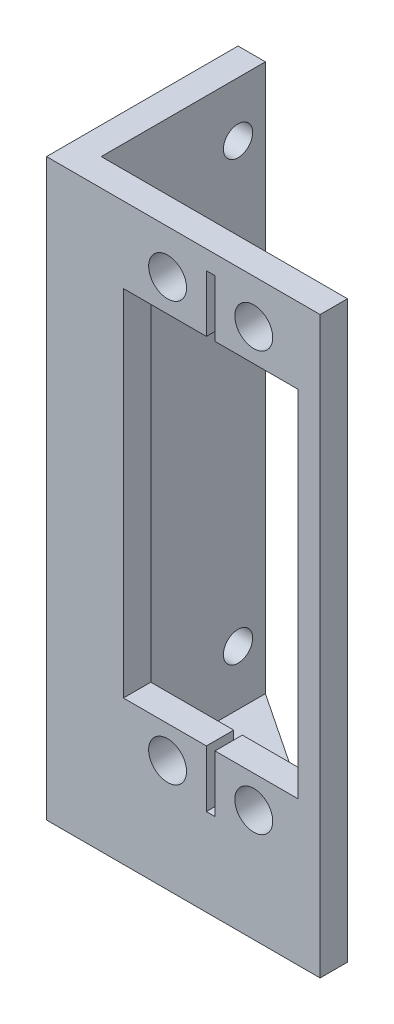
ISO-10303-21;
HEADER;
FILE_DESCRIPTION(('STEP AP214'),'2;1');
FILE_NAME('part.step','',(''),(''),'','','');
FILE_SCHEMA(('AUTOMOTIVE_DESIGN { 1 0 10303 214 1 1 1 1 }'));
ENDSEC;
DATA;
#1=APPLICATION_CONTEXT('core data for automotive mechanical design processes');
#2=APPLICATION_PROTOCOL_DEFINITION('international standard','automotive_design',2000,#1);
#3=PRODUCT_CONTEXT('',#1,'mechanical');
#4=PRODUCT('Part','Part','',(#3));
#5=PRODUCT_RELATED_PRODUCT_CATEGORY('part','',(#4));
#6=PRODUCT_DEFINITION_FORMATION('','',#4);
#7=PRODUCT_DEFINITION_CONTEXT('part definition',#1,'design');
#8=PRODUCT_DEFINITION('design','',#6,#7);
#9=PRODUCT_DEFINITION_SHAPE('','',#8);
#10=(LENGTH_UNIT() NAMED_UNIT(*) SI_UNIT(.MILLI.,.METRE.));
#11=(NAMED_UNIT(*) PLANE_ANGLE_UNIT() SI_UNIT($,.RADIAN.));
#12=(NAMED_UNIT(*) SI_UNIT($,.STERADIAN.) SOLID_ANGLE_UNIT());
#13=UNCERTAINTY_MEASURE_WITH_UNIT(LENGTH_MEASURE(1.E-05),#10,'distance_accuracy_value','');
#14=(GEOMETRIC_REPRESENTATION_CONTEXT(3) GLOBAL_UNCERTAINTY_ASSIGNED_CONTEXT((#13)) GLOBAL_UNIT_ASSIGNED_CONTEXT((#10,
#11,#12)) REPRESENTATION_CONTEXT('',''));
#15=CARTESIAN_POINT('',(0.,0.,0.));
#16=DIRECTION('',(0.,0.,1.));
#17=DIRECTION('',(1.,0.,0.));
#18=AXIS2_PLACEMENT_3D('',#15,#16,#17);
#19=CARTESIAN_POINT('',(31.75,0.,3.175));
#20=DIRECTION('',(-1.,0.,0.));
#21=DIRECTION('',(0.,-1.,0.));
#22=AXIS2_PLACEMENT_3D('',#19,#20,#21);
#23=PLANE('',#22);
#24=DIRECTION('',(0.,1.,0.));
#25=VECTOR('',#24,1.);
#26=CARTESIAN_POINT('',(31.75,0.,0.));
#27=LINE('',#26,#25);
#28=CARTESIAN_POINT('',(31.75,0.,0.));
#29=VERTEX_POINT('',#28);
#30=CARTESIAN_POINT('',(31.75,63.5,0.));
#31=VERTEX_POINT('',#30);
#32=EDGE_CURVE('E347',#29,#31,#27,.T.);
#33=ORIENTED_EDGE('',*,*,#32,.T.);
#34=DIRECTION('',(0.,0.,-1.));
#35=VECTOR('',#34,1.);
#36=CARTESIAN_POINT('',(31.75,63.5,3.175));
#37=LINE('',#36,#35);
#38=CARTESIAN_POINT('',(31.75,63.5,3.175));
#39=VERTEX_POINT('',#38);
#40=EDGE_CURVE('E11',#39,#31,#37,.T.);
#41=ORIENTED_EDGE('',*,*,#40,.F.);
#42=DIRECTION('',(0.,1.,0.));
#43=VECTOR('',#42,1.);
#44=CARTESIAN_POINT('',(31.75,0.,3.175));
#45=LINE('',#44,#43);
#46=CARTESIAN_POINT('',(31.75,-3.175,3.175));
#47=VERTEX_POINT('',#46);
#48=EDGE_CURVE('E337',#47,#39,#45,.T.);
#49=ORIENTED_EDGE('',*,*,#48,.F.);
#50=DIRECTION('',(0.,0.,1.));
#51=VECTOR('',#50,1.);
#52=CARTESIAN_POINT('',(31.75,-3.175,3.175));
#53=LINE('',#52,#51);
#54=CARTESIAN_POINT('',(31.75,-3.175,0.));
#55=VERTEX_POINT('',#54);
#56=EDGE_CURVE('E203',#55,#47,#53,.T.);
#57=ORIENTED_EDGE('',*,*,#56,.F.);
#58=DIRECTION('',(0.,1.,0.));
#59=VECTOR('',#58,1.);
#60=CARTESIAN_POINT('',(31.75,-3.175,0.));
#61=LINE('',#60,#59);
#62=EDGE_CURVE('E205',#55,#29,#61,.T.);
#63=ORIENTED_EDGE('',*,*,#62,.T.);
#64=EDGE_LOOP('',(#33,#41,#49,#57,#63));
#65=FACE_BOUND('',#64,.T.);
#66=ADVANCED_FACE('F36',(#65),#23,.F.);
#67=CARTESIAN_POINT('',(0.,63.5,3.175));
#68=DIRECTION('',(0.,1.,0.));
#69=DIRECTION('',(0.,0.,1.));
#70=AXIS2_PLACEMENT_3D('',#67,#68,#69);
#71=PLANE('',#70);
#72=DIRECTION('',(1.,0.,0.));
#73=VECTOR('',#72,1.);
#74=CARTESIAN_POINT('',(0.,63.5,0.));
#75=LINE('',#74,#73);
#76=CARTESIAN_POINT('',(3.175,63.5,0.));
#77=VERTEX_POINT('',#76);
#78=EDGE_CURVE('E340',#77,#31,#75,.T.);
#79=ORIENTED_EDGE('',*,*,#78,.F.);
#80=DIRECTION('',(0.,0.,1.));
#81=VECTOR('',#80,1.);
#82=CARTESIAN_POINT('',(3.175,63.5,-19.05));
#83=LINE('',#82,#81);
#84=CARTESIAN_POINT('',(3.175,63.5,-19.05));
#85=VERTEX_POINT('',#84);
#86=EDGE_CURVE('E50',#85,#77,#83,.T.);
#87=ORIENTED_EDGE('',*,*,#86,.F.);
#88=DIRECTION('',(-1.,0.,0.));
#89=VECTOR('',#88,1.);
#90=CARTESIAN_POINT('',(0.,63.5,-19.05));
#91=LINE('',#90,#89);
#92=CARTESIAN_POINT('',(0.,63.5,-19.05));
#93=VERTEX_POINT('',#92);
#94=EDGE_CURVE('E211',#85,#93,#91,.T.);
#95=ORIENTED_EDGE('',*,*,#94,.T.);
#96=DIRECTION('',(0.,0.,-1.));
#97=VECTOR('',#96,1.);
#98=CARTESIAN_POINT('',(0.,63.5,3.175));
#99=LINE('',#98,#97);
#100=CARTESIAN_POINT('',(0.,63.5,3.175));
#101=VERTEX_POINT('',#100);
#102=EDGE_CURVE('E43',#101,#93,#99,.T.);
#103=ORIENTED_EDGE('',*,*,#102,.F.);
#104=DIRECTION('',(1.,0.,0.));
#105=VECTOR('',#104,1.);
#106=CARTESIAN_POINT('',(0.,63.5,3.175));
#107=LINE('',#106,#105);
#108=EDGE_CURVE('E339',#101,#39,#107,.T.);
#109=ORIENTED_EDGE('',*,*,#108,.T.);
#110=ORIENTED_EDGE('',*,*,#40,.T.);
#111=EDGE_LOOP('',(#79,#87,#95,#103,#109,#110));
#112=FACE_BOUND('',#111,.T.);
#113=ADVANCED_FACE('F356',(#112),#71,.T.);
#114=CARTESIAN_POINT('',(0.,0.,3.175));
#115=DIRECTION('',(-1.,0.,0.));
#116=DIRECTION('',(0.,-1.,0.));
#117=AXIS2_PLACEMENT_3D('',#114,#115,#116);
#118=PLANE('',#117);
#119=CARTESIAN_POINT('',(0.,6.35,-3.175));
#120=DIRECTION('',(1.,0.,0.));
#121=DIRECTION('',(0.,1.,0.));
#122=AXIS2_PLACEMENT_3D('',#119,#120,#121);
#123=CIRCLE('',#122,1.700000029);
#124=CARTESIAN_POINT('',(0.,8.050000029,-3.175));
#125=VERTEX_POINT('',#124);
#126=EDGE_CURVE('E774',#125,#125,#123,.T.);
#127=ORIENTED_EDGE('',*,*,#126,.T.);
#128=EDGE_LOOP('',(#127));
#129=FACE_BOUND('',#128,.T.);
#130=CARTESIAN_POINT('',(0.,57.15,-15.875));
#131=DIRECTION('',(1.,0.,0.));
#132=DIRECTION('',(0.,1.,0.));
#133=AXIS2_PLACEMENT_3D('',#130,#131,#132);
#134=CIRCLE('',#133,1.700000029);
#135=CARTESIAN_POINT('',(0.,58.850000029,-15.875));
#136=VERTEX_POINT('',#135);
#137=EDGE_CURVE('E788',#136,#136,#134,.T.);
#138=ORIENTED_EDGE('',*,*,#137,.T.);
#139=EDGE_LOOP('',(#138));
#140=FACE_BOUND('',#139,.T.);
#141=CARTESIAN_POINT('',(0.,6.35,-15.875));
#142=DIRECTION('',(1.,0.,0.));
#143=DIRECTION('',(0.,1.,0.));
#144=AXIS2_PLACEMENT_3D('',#141,#142,#143);
#145=CIRCLE('',#144,1.700000029);
#146=CARTESIAN_POINT('',(0.,8.050000029,-15.875));
#147=VERTEX_POINT('',#146);
#148=EDGE_CURVE('E783',#147,#147,#145,.T.);
#149=ORIENTED_EDGE('',*,*,#148,.T.);
#150=EDGE_LOOP('',(#149));
#151=FACE_BOUND('',#150,.T.);
#152=CARTESIAN_POINT('',(0.,57.15,-3.175));
#153=DIRECTION('',(1.,0.,0.));
#154=DIRECTION('',(0.,1.,0.));
#155=AXIS2_PLACEMENT_3D('',#152,#153,#154);
#156=CIRCLE('',#155,1.700000029);
#157=CARTESIAN_POINT('',(0.,58.850000029,-3.175));
#158=VERTEX_POINT('',#157);
#159=EDGE_CURVE('E196',#158,#158,#156,.T.);
#160=ORIENTED_EDGE('',*,*,#159,.T.);
#161=EDGE_LOOP('',(#160));
#162=FACE_BOUND('',#161,.T.);
#163=ORIENTED_EDGE('',*,*,#102,.T.);
#164=DIRECTION('',(0.,-1.,0.));
#165=VECTOR('',#164,1.);
#166=CARTESIAN_POINT('',(0.,0.,-19.05));
#167=LINE('',#166,#165);
#168=CARTESIAN_POINT('',(0.,-3.175,-19.05));
#169=VERTEX_POINT('',#168);
#170=EDGE_CURVE('E166',#93,#169,#167,.T.);
#171=ORIENTED_EDGE('',*,*,#170,.T.);
#172=DIRECTION('',(0.,0.,-1.));
#173=VECTOR('',#172,1.);
#174=CARTESIAN_POINT('',(0.,-3.175,-19.05));
#175=LINE('',#174,#173);
#176=CARTESIAN_POINT('',(0.,-3.175,3.175));
#177=VERTEX_POINT('',#176);
#178=EDGE_CURVE('E171',#177,#169,#175,.T.);
#179=ORIENTED_EDGE('',*,*,#178,.F.);
#180=DIRECTION('',(0.,1.,0.));
#181=VECTOR('',#180,1.);
#182=CARTESIAN_POINT('',(0.,0.,3.175));
#183=LINE('',#182,#181);
#184=EDGE_CURVE('E343',#177,#101,#183,.T.);
#185=ORIENTED_EDGE('',*,*,#184,.T.);
#186=EDGE_LOOP('',(#163,#171,#179,#185));
#187=FACE_BOUND('',#186,.T.);
#188=ADVANCED_FACE('F168',(#129,#140,#151,#162,#187),#118,.T.);
#189=CARTESIAN_POINT('',(0.,0.,3.175));
#190=DIRECTION('',(0.,0.,1.));
#191=DIRECTION('',(1.,0.,0.));
#192=AXIS2_PLACEMENT_3D('',#189,#190,#191);
#193=PLANE('',#192);
#194=CARTESIAN_POINT('',(24.050000033,9.82700003100002,3.175));
#195=DIRECTION('',(0.,0.,1.));
#196=DIRECTION('',(1.,0.,0.));
#197=AXIS2_PLACEMENT_3D('',#194,#195,#196);
#198=CIRCLE('',#197,2.200000045);
#199=CARTESIAN_POINT('',(26.250000078,9.82700003100002,3.175));
#200=VERTEX_POINT('',#199);
#201=EDGE_CURVE('E319',#200,#200,#198,.T.);
#202=ORIENTED_EDGE('',*,*,#201,.F.);
#203=EDGE_LOOP('',(#202));
#204=FACE_BOUND('',#203,.T.);
#205=CARTESIAN_POINT('',(14.049999967,58.427000113,3.175));
#206=DIRECTION('',(0.,0.,1.));
#207=DIRECTION('',(1.,0.,0.));
#208=AXIS2_PLACEMENT_3D('',#205,#206,#207);
#209=CIRCLE('',#208,2.200000045);
#210=CARTESIAN_POINT('',(16.250000012,58.427000113,3.175));
#211=VERTEX_POINT('',#210);
#212=EDGE_CURVE('E326',#211,#211,#209,.T.);
#213=ORIENTED_EDGE('',*,*,#212,.F.);
#214=EDGE_LOOP('',(#213));
#215=FACE_BOUND('',#214,.T.);
#216=DIRECTION('',(0.,-1.,0.));
#217=VECTOR('',#216,1.);
#218=CARTESIAN_POINT('',(8.923000061,54.704000066,3.175));
#219=LINE('',#218,#217);
#220=CARTESIAN_POINT('',(8.923000061,54.704000066,3.175));
#221=VERTEX_POINT('',#220);
#222=CARTESIAN_POINT('',(8.923000061,13.550000078,3.175));
#223=VERTEX_POINT('',#222);
#224=EDGE_CURVE('E58',#221,#223,#219,.T.);
#225=ORIENTED_EDGE('',*,*,#224,.F.);
#226=DIRECTION('',(-1.,0.,0.));
#227=VECTOR('',#226,1.);
#228=CARTESIAN_POINT('',(8.923000061,54.704000066,3.175));
#229=LINE('',#228,#227);
#230=CARTESIAN_POINT('',(18.55,54.704000066,3.175));
#231=VERTEX_POINT('',#230);
#232=EDGE_CURVE('E243',#231,#221,#229,.T.);
#233=ORIENTED_EDGE('',*,*,#232,.F.);
#234=DIRECTION('',(0.,-1.,0.));
#235=VECTOR('',#234,1.);
#236=CARTESIAN_POINT('',(18.55,54.704000066,3.175));
#237=LINE('',#236,#235);
#238=CARTESIAN_POINT('',(18.55,61.308000066,3.175));
#239=VERTEX_POINT('',#238);
#240=EDGE_CURVE('E246',#239,#231,#237,.T.);
#241=ORIENTED_EDGE('',*,*,#240,.F.);
#242=DIRECTION('',(-1.,0.,0.));
#243=VECTOR('',#242,1.);
#244=CARTESIAN_POINT('',(18.55,61.308000066,3.175));
#245=LINE('',#244,#243);
#246=CARTESIAN_POINT('',(19.55,61.308000066,3.175));
#247=VERTEX_POINT('',#246);
#248=EDGE_CURVE('E250',#247,#239,#245,.T.);
#249=ORIENTED_EDGE('',*,*,#248,.F.);
#250=DIRECTION('',(0.,1.,0.));
#251=VECTOR('',#250,1.);
#252=CARTESIAN_POINT('',(19.55,54.704000066,3.175));
#253=LINE('',#252,#251);
#254=CARTESIAN_POINT('',(19.55,54.704000066,3.175));
#255=VERTEX_POINT('',#254);
#256=EDGE_CURVE('E253',#255,#247,#253,.T.);
#257=ORIENTED_EDGE('',*,*,#256,.F.);
#258=DIRECTION('',(-1.,0.,0.));
#259=VECTOR('',#258,1.);
#260=CARTESIAN_POINT('',(19.55,54.704000066,3.175));
#261=LINE('',#260,#259);
#262=CARTESIAN_POINT('',(29.176999939,54.704000066,3.175));
#263=VERTEX_POINT('',#262);
#264=EDGE_CURVE('E256',#263,#255,#261,.T.);
#265=ORIENTED_EDGE('',*,*,#264,.F.);
#266=DIRECTION('',(0.,1.,0.));
#267=VECTOR('',#266,1.);
#268=CARTESIAN_POINT('',(29.176999939,54.704000066,3.175));
#269=LINE('',#268,#267);
#270=CARTESIAN_POINT('',(29.176999939,13.550000078,3.175));
#271=VERTEX_POINT('',#270);
#272=EDGE_CURVE('E259',#271,#263,#269,.T.);
#273=ORIENTED_EDGE('',*,*,#272,.F.);
#274=DIRECTION('',(1.,0.,0.));
#275=VECTOR('',#274,1.);
#276=CARTESIAN_POINT('',(19.55,13.550000078,3.175));
#277=LINE('',#276,#275);
#278=CARTESIAN_POINT('',(19.55,13.550000078,3.175));
#279=VERTEX_POINT('',#278);
#280=EDGE_CURVE('E262',#279,#271,#277,.T.);
#281=ORIENTED_EDGE('',*,*,#280,.F.);
#282=DIRECTION('',(0.,1.,0.));
#283=VECTOR('',#282,1.);
#284=CARTESIAN_POINT('',(19.55,13.550000078,3.175));
#285=LINE('',#284,#283);
#286=CARTESIAN_POINT('',(19.55,6.94600007800001,3.175));
#287=VERTEX_POINT('',#286);
#288=EDGE_CURVE('E265',#287,#279,#285,.T.);
#289=ORIENTED_EDGE('',*,*,#288,.F.);
#290=DIRECTION('',(1.,0.,0.));
#291=VECTOR('',#290,1.);
#292=CARTESIAN_POINT('',(18.55,6.94600007800004,3.175));
#293=LINE('',#292,#291);
#294=CARTESIAN_POINT('',(18.55,6.94600007800004,3.175));
#295=VERTEX_POINT('',#294);
#296=EDGE_CURVE('E268',#295,#287,#293,.T.);
#297=ORIENTED_EDGE('',*,*,#296,.F.);
#298=DIRECTION('',(0.,-1.,0.));
#299=VECTOR('',#298,1.);
#300=CARTESIAN_POINT('',(18.55,13.550000078,3.175));
#301=LINE('',#300,#299);
#302=CARTESIAN_POINT('',(18.55,13.550000078,3.175));
#303=VERTEX_POINT('',#302);
#304=EDGE_CURVE('E271',#303,#295,#301,.T.);
#305=ORIENTED_EDGE('',*,*,#304,.F.);
#306=DIRECTION('',(1.,0.,0.));
#307=VECTOR('',#306,1.);
#308=CARTESIAN_POINT('',(8.923000061,13.550000078,3.175));
#309=LINE('',#308,#307);
#310=EDGE_CURVE('E274',#223,#303,#309,.T.);
#311=ORIENTED_EDGE('',*,*,#310,.F.);
#312=EDGE_LOOP('',(#225,#233,#241,#249,#257,#265,#273,#281,#289,#297,#305,#311));
#313=FACE_BOUND('',#312,.T.);
#314=CARTESIAN_POINT('',(24.050000033,58.427000113,3.175));
#315=DIRECTION('',(0.,0.,1.));
#316=DIRECTION('',(1.,0.,0.));
#317=AXIS2_PLACEMENT_3D('',#314,#315,#316);
#318=CIRCLE('',#317,2.200000045);
#319=CARTESIAN_POINT('',(26.250000078,58.427000113,3.175));
#320=VERTEX_POINT('',#319);
#321=EDGE_CURVE('E313',#320,#320,#318,.T.);
#322=ORIENTED_EDGE('',*,*,#321,.F.);
#323=EDGE_LOOP('',(#322));
#324=FACE_BOUND('',#323,.T.);
#325=CARTESIAN_POINT('',(14.049999967,9.82700003100002,3.175));
#326=DIRECTION('',(0.,0.,1.));
#327=DIRECTION('',(1.,0.,0.));
#328=AXIS2_PLACEMENT_3D('',#325,#326,#327);
#329=CIRCLE('',#328,2.200000045);
#330=CARTESIAN_POINT('',(16.250000012,9.82700003100002,3.175));
#331=VERTEX_POINT('',#330);
#332=EDGE_CURVE('E322',#331,#331,#329,.T.);
#333=ORIENTED_EDGE('',*,*,#332,.F.);
#334=EDGE_LOOP('',(#333));
#335=FACE_BOUND('',#334,.T.);
#336=ORIENTED_EDGE('',*,*,#184,.F.);
#337=DIRECTION('',(-1.,0.,0.));
#338=VECTOR('',#337,1.);
#339=CARTESIAN_POINT('',(0.,-3.175,3.175));
#340=LINE('',#339,#338);
#341=EDGE_CURVE('E192',#47,#177,#340,.T.);
#342=ORIENTED_EDGE('',*,*,#341,.F.);
#343=ORIENTED_EDGE('',*,*,#48,.T.);
#344=ORIENTED_EDGE('',*,*,#108,.F.);
#345=EDGE_LOOP('',(#336,#342,#343,#344));
#346=FACE_BOUND('',#345,.T.);
#347=ADVANCED_FACE('F368',(#204,#215,#313,#324,#335,#346),#193,.T.);
#348=CARTESIAN_POINT('',(0.,0.,0.));
#349=DIRECTION('',(0.,0.,1.));
#350=DIRECTION('',(1.,0.,0.));
#351=AXIS2_PLACEMENT_3D('',#348,#349,#350);
#352=PLANE('',#351);
#353=CARTESIAN_POINT('',(24.050000033,9.82700003100002,0.));
#354=DIRECTION('',(0.,0.,1.));
#355=DIRECTION('',(1.,0.,0.));
#356=AXIS2_PLACEMENT_3D('',#353,#354,#355);
#357=CIRCLE('',#356,2.200000045);
#358=CARTESIAN_POINT('',(26.250000078,9.82700003100002,0.));
#359=VERTEX_POINT('',#358);
#360=EDGE_CURVE('E323',#359,#359,#357,.T.);
#361=ORIENTED_EDGE('',*,*,#360,.T.);
#362=EDGE_LOOP('',(#361));
#363=FACE_BOUND('',#362,.T.);
#364=CARTESIAN_POINT('',(14.049999967,58.427000113,0.));
#365=DIRECTION('',(0.,0.,1.));
#366=DIRECTION('',(1.,0.,0.));
#367=AXIS2_PLACEMENT_3D('',#364,#365,#366);
#368=CIRCLE('',#367,2.200000045);
#369=CARTESIAN_POINT('',(16.250000012,58.427000113,0.));
#370=VERTEX_POINT('',#369);
#371=EDGE_CURVE('E316',#370,#370,#368,.T.);
#372=ORIENTED_EDGE('',*,*,#371,.T.);
#373=EDGE_LOOP('',(#372));
#374=FACE_BOUND('',#373,.T.);
#375=DIRECTION('',(-1.,0.,0.));
#376=VECTOR('',#375,1.);
#377=CARTESIAN_POINT('',(8.923000061,54.704000066,0.));
#378=LINE('',#377,#376);
#379=CARTESIAN_POINT('',(18.55,54.704000066,0.));
#380=VERTEX_POINT('',#379);
#381=CARTESIAN_POINT('',(8.923000061,54.704000066,0.));
#382=VERTEX_POINT('',#381);
#383=EDGE_CURVE('E221',#380,#382,#378,.T.);
#384=ORIENTED_EDGE('',*,*,#383,.T.);
#385=DIRECTION('',(0.,-1.,0.));
#386=VECTOR('',#385,1.);
#387=CARTESIAN_POINT('',(8.923000061,54.704000066,0.));
#388=LINE('',#387,#386);
#389=CARTESIAN_POINT('',(8.923000061,13.550000078,0.));
#390=VERTEX_POINT('',#389);
#391=EDGE_CURVE('E247',#382,#390,#388,.T.);
#392=ORIENTED_EDGE('',*,*,#391,.T.);
#393=DIRECTION('',(1.,0.,0.));
#394=VECTOR('',#393,1.);
#395=CARTESIAN_POINT('',(8.923000061,13.550000078,0.));
#396=LINE('',#395,#394);
#397=CARTESIAN_POINT('',(18.55,13.550000078,0.));
#398=VERTEX_POINT('',#397);
#399=EDGE_CURVE('E308',#390,#398,#396,.T.);
#400=ORIENTED_EDGE('',*,*,#399,.T.);
#401=DIRECTION('',(0.,-1.,0.));
#402=VECTOR('',#401,1.);
#403=CARTESIAN_POINT('',(18.55,13.550000078,0.));
#404=LINE('',#403,#402);
#405=CARTESIAN_POINT('',(18.55,6.94600007800004,0.));
#406=VERTEX_POINT('',#405);
#407=EDGE_CURVE('E305',#398,#406,#404,.T.);
#408=ORIENTED_EDGE('',*,*,#407,.T.);
#409=DIRECTION('',(1.,0.,0.));
#410=VECTOR('',#409,1.);
#411=CARTESIAN_POINT('',(18.55,6.94600007800004,0.));
#412=LINE('',#411,#410);
#413=CARTESIAN_POINT('',(19.55,6.94600007800001,0.));
#414=VERTEX_POINT('',#413);
#415=EDGE_CURVE('E302',#406,#414,#412,.T.);
#416=ORIENTED_EDGE('',*,*,#415,.T.);
#417=DIRECTION('',(0.,1.,0.));
#418=VECTOR('',#417,1.);
#419=CARTESIAN_POINT('',(19.55,13.550000078,0.));
#420=LINE('',#419,#418);
#421=CARTESIAN_POINT('',(19.55,13.550000078,0.));
#422=VERTEX_POINT('',#421);
#423=EDGE_CURVE('E299',#414,#422,#420,.T.);
#424=ORIENTED_EDGE('',*,*,#423,.T.);
#425=DIRECTION('',(1.,0.,0.));
#426=VECTOR('',#425,1.);
#427=CARTESIAN_POINT('',(19.55,13.550000078,0.));
#428=LINE('',#427,#426);
#429=CARTESIAN_POINT('',(29.176999939,13.550000078,0.));
#430=VERTEX_POINT('',#429);
#431=EDGE_CURVE('E296',#422,#430,#428,.T.);
#432=ORIENTED_EDGE('',*,*,#431,.T.);
#433=DIRECTION('',(0.,1.,0.));
#434=VECTOR('',#433,1.);
#435=CARTESIAN_POINT('',(29.176999939,54.704000066,0.));
#436=LINE('',#435,#434);
#437=CARTESIAN_POINT('',(29.176999939,54.704000066,0.));
#438=VERTEX_POINT('',#437);
#439=EDGE_CURVE('E293',#430,#438,#436,.T.);
#440=ORIENTED_EDGE('',*,*,#439,.T.);
#441=DIRECTION('',(-1.,0.,0.));
#442=VECTOR('',#441,1.);
#443=CARTESIAN_POINT('',(19.55,54.704000066,0.));
#444=LINE('',#443,#442);
#445=CARTESIAN_POINT('',(19.55,54.704000066,0.));
#446=VERTEX_POINT('',#445);
#447=EDGE_CURVE('E290',#438,#446,#444,.T.);
#448=ORIENTED_EDGE('',*,*,#447,.T.);
#449=DIRECTION('',(0.,1.,0.));
#450=VECTOR('',#449,1.);
#451=CARTESIAN_POINT('',(19.55,54.704000066,0.));
#452=LINE('',#451,#450);
#453=CARTESIAN_POINT('',(19.55,61.308000066,0.));
#454=VERTEX_POINT('',#453);
#455=EDGE_CURVE('E287',#446,#454,#452,.T.);
#456=ORIENTED_EDGE('',*,*,#455,.T.);
#457=DIRECTION('',(-1.,0.,0.));
#458=VECTOR('',#457,1.);
#459=CARTESIAN_POINT('',(18.55,61.308000066,0.));
#460=LINE('',#459,#458);
#461=CARTESIAN_POINT('',(18.55,61.308000066,0.));
#462=VERTEX_POINT('',#461);
#463=EDGE_CURVE('E284',#454,#462,#460,.T.);
#464=ORIENTED_EDGE('',*,*,#463,.T.);
#465=DIRECTION('',(0.,-1.,0.));
#466=VECTOR('',#465,1.);
#467=CARTESIAN_POINT('',(18.55,54.704000066,0.));
#468=LINE('',#467,#466);
#469=EDGE_CURVE('E281',#462,#380,#468,.T.);
#470=ORIENTED_EDGE('',*,*,#469,.T.);
#471=EDGE_LOOP('',(#384,#392,#400,#408,#416,#424,#432,#440,#448,#456,#464,#470));
#472=FACE_BOUND('',#471,.T.);
#473=CARTESIAN_POINT('',(24.050000033,58.427000113,0.));
#474=DIRECTION('',(0.,0.,1.));
#475=DIRECTION('',(1.,0.,0.));
#476=AXIS2_PLACEMENT_3D('',#473,#474,#475);
#477=CIRCLE('',#476,2.200000045);
#478=CARTESIAN_POINT('',(26.250000078,58.427000113,0.));
#479=VERTEX_POINT('',#478);
#480=EDGE_CURVE('E278',#479,#479,#477,.T.);
#481=ORIENTED_EDGE('',*,*,#480,.T.);
#482=EDGE_LOOP('',(#481));
#483=FACE_BOUND('',#482,.T.);
#484=CARTESIAN_POINT('',(14.049999967,9.82700003100002,0.));
#485=DIRECTION('',(0.,0.,1.));
#486=DIRECTION('',(1.,0.,0.));
#487=AXIS2_PLACEMENT_3D('',#484,#485,#486);
#488=CIRCLE('',#487,2.200000045);
#489=CARTESIAN_POINT('',(16.250000012,9.82700003100002,0.));
#490=VERTEX_POINT('',#489);
#491=EDGE_CURVE('E331',#490,#490,#488,.T.);
#492=ORIENTED_EDGE('',*,*,#491,.T.);
#493=EDGE_LOOP('',(#492));
#494=FACE_BOUND('',#493,.T.);
#495=DIRECTION('',(1.,0.,0.));
#496=VECTOR('',#495,1.);
#497=CARTESIAN_POINT('',(0.,0.,0.));
#498=LINE('',#497,#496);
#499=CARTESIAN_POINT('',(3.17500000000001,0.,0.));
#500=VERTEX_POINT('',#499);
#501=EDGE_CURVE('E334',#500,#29,#498,.T.);
#502=ORIENTED_EDGE('',*,*,#501,.F.);
#503=DIRECTION('',(0.,1.,0.));
#504=VECTOR('',#503,1.);
#505=CARTESIAN_POINT('',(3.17500000000001,0.,0.));
#506=LINE('',#505,#504);
#507=EDGE_CURVE('E176',#500,#77,#506,.T.);
#508=ORIENTED_EDGE('',*,*,#507,.T.);
#509=ORIENTED_EDGE('',*,*,#78,.T.);
#510=ORIENTED_EDGE('',*,*,#32,.F.);
#511=EDGE_LOOP('',(#502,#508,#509,#510));
#512=FACE_BOUND('',#511,.T.);
#513=ADVANCED_FACE('F353',(#363,#374,#472,#483,#494,#512),#352,.F.);
#514=CARTESIAN_POINT('',(14.049999967,9.82700003100002,0.));
#515=DIRECTION('',(0.,0.,1.));
#516=DIRECTION('',(1.,0.,0.));
#517=AXIS2_PLACEMENT_3D('',#514,#515,#516);
#518=CYLINDRICAL_SURFACE('',#517,2.200000045);
#519=ORIENTED_EDGE('',*,*,#491,.F.);
#520=EDGE_LOOP('',(#519));
#521=FACE_BOUND('',#520,.T.);
#522=ORIENTED_EDGE('',*,*,#332,.T.);
#523=EDGE_LOOP('',(#522));
#524=FACE_BOUND('',#523,.T.);
#525=ADVANCED_FACE('F376',(#521,#524),#518,.F.);
#526=CARTESIAN_POINT('',(24.050000033,58.427000113,0.));
#527=DIRECTION('',(0.,0.,1.));
#528=DIRECTION('',(1.,0.,0.));
#529=AXIS2_PLACEMENT_3D('',#526,#527,#528);
#530=CYLINDRICAL_SURFACE('',#529,2.200000045);
#531=ORIENTED_EDGE('',*,*,#480,.F.);
#532=EDGE_LOOP('',(#531));
#533=FACE_BOUND('',#532,.T.);
#534=ORIENTED_EDGE('',*,*,#321,.T.);
#535=EDGE_LOOP('',(#534));
#536=FACE_BOUND('',#535,.T.);
#537=ADVANCED_FACE('F629',(#533,#536),#530,.F.);
#538=CARTESIAN_POINT('',(8.923000061,54.704000066,0.));
#539=DIRECTION('',(-1.,0.,0.));
#540=DIRECTION('',(0.,0.,1.));
#541=AXIS2_PLACEMENT_3D('',#538,#539,#540);
#542=PLANE('',#541);
#543=ORIENTED_EDGE('',*,*,#224,.T.);
#544=DIRECTION('',(0.,0.,1.));
#545=VECTOR('',#544,1.);
#546=CARTESIAN_POINT('',(8.923000061,13.550000078,0.));
#547=LINE('',#546,#545);
#548=EDGE_CURVE('E219',#390,#223,#547,.T.);
#549=ORIENTED_EDGE('',*,*,#548,.F.);
#550=ORIENTED_EDGE('',*,*,#391,.F.);
#551=DIRECTION('',(0.,0.,1.));
#552=VECTOR('',#551,1.);
#553=CARTESIAN_POINT('',(8.923000061,54.704000066,0.));
#554=LINE('',#553,#552);
#555=EDGE_CURVE('E216',#382,#221,#554,.T.);
#556=ORIENTED_EDGE('',*,*,#555,.T.);
#557=EDGE_LOOP('',(#543,#549,#550,#556));
#558=FACE_BOUND('',#557,.T.);
#559=ADVANCED_FACE('F619',(#558),#542,.F.);
#560=CARTESIAN_POINT('',(8.923000061,54.704000066,0.));
#561=DIRECTION('',(0.,1.,0.));
#562=DIRECTION('',(0.,0.,1.));
#563=AXIS2_PLACEMENT_3D('',#560,#561,#562);
#564=PLANE('',#563);
#565=ORIENTED_EDGE('',*,*,#232,.T.);
#566=ORIENTED_EDGE('',*,*,#555,.F.);
#567=ORIENTED_EDGE('',*,*,#383,.F.);
#568=DIRECTION('',(0.,0.,1.));
#569=VECTOR('',#568,1.);
#570=CARTESIAN_POINT('',(18.55,54.704000066,0.));
#571=LINE('',#570,#569);
#572=EDGE_CURVE('E240',#380,#231,#571,.T.);
#573=ORIENTED_EDGE('',*,*,#572,.T.);
#574=EDGE_LOOP('',(#565,#566,#567,#573));
#575=FACE_BOUND('',#574,.T.);
#576=ADVANCED_FACE('F609',(#575),#564,.F.);
#577=CARTESIAN_POINT('',(18.55,54.704000066,0.));
#578=DIRECTION('',(-1.,0.,0.));
#579=DIRECTION('',(0.,0.,1.));
#580=AXIS2_PLACEMENT_3D('',#577,#578,#579);
#581=PLANE('',#580);
#582=ORIENTED_EDGE('',*,*,#240,.T.);
#583=ORIENTED_EDGE('',*,*,#572,.F.);
#584=ORIENTED_EDGE('',*,*,#469,.F.);
#585=DIRECTION('',(0.,0.,1.));
#586=VECTOR('',#585,1.);
#587=CARTESIAN_POINT('',(18.55,61.308000066,0.));
#588=LINE('',#587,#586);
#589=EDGE_CURVE('E238',#462,#239,#588,.T.);
#590=ORIENTED_EDGE('',*,*,#589,.T.);
#591=EDGE_LOOP('',(#582,#583,#584,#590));
#592=FACE_BOUND('',#591,.T.);
#593=ADVANCED_FACE('F599',(#592),#581,.F.);
#594=CARTESIAN_POINT('',(18.55,61.308000066,0.));
#595=DIRECTION('',(0.,1.,0.));
#596=DIRECTION('',(0.,0.,1.));
#597=AXIS2_PLACEMENT_3D('',#594,#595,#596);
#598=PLANE('',#597);
#599=ORIENTED_EDGE('',*,*,#248,.T.);
#600=ORIENTED_EDGE('',*,*,#589,.F.);
#601=ORIENTED_EDGE('',*,*,#463,.F.);
#602=DIRECTION('',(0.,0.,1.));
#603=VECTOR('',#602,1.);
#604=CARTESIAN_POINT('',(19.55,61.308000066,0.));
#605=LINE('',#604,#603);
#606=EDGE_CURVE('E236',#454,#247,#605,.T.);
#607=ORIENTED_EDGE('',*,*,#606,.T.);
#608=EDGE_LOOP('',(#599,#600,#601,#607));
#609=FACE_BOUND('',#608,.T.);
#610=ADVANCED_FACE('F589',(#609),#598,.F.);
#611=CARTESIAN_POINT('',(19.55,54.704000066,0.));
#612=DIRECTION('',(1.,0.,0.));
#613=DIRECTION('',(0.,0.,-1.));
#614=AXIS2_PLACEMENT_3D('',#611,#612,#613);
#615=PLANE('',#614);
#616=ORIENTED_EDGE('',*,*,#256,.T.);
#617=ORIENTED_EDGE('',*,*,#606,.F.);
#618=ORIENTED_EDGE('',*,*,#455,.F.);
#619=DIRECTION('',(0.,0.,1.));
#620=VECTOR('',#619,1.);
#621=CARTESIAN_POINT('',(19.55,54.704000066,0.));
#622=LINE('',#621,#620);
#623=EDGE_CURVE('E234',#446,#255,#622,.T.);
#624=ORIENTED_EDGE('',*,*,#623,.T.);
#625=EDGE_LOOP('',(#616,#617,#618,#624));
#626=FACE_BOUND('',#625,.T.);
#627=ADVANCED_FACE('F579',(#626),#615,.F.);
#628=CARTESIAN_POINT('',(19.55,54.704000066,0.));
#629=DIRECTION('',(0.,1.,0.));
#630=DIRECTION('',(0.,0.,1.));
#631=AXIS2_PLACEMENT_3D('',#628,#629,#630);
#632=PLANE('',#631);
#633=ORIENTED_EDGE('',*,*,#264,.T.);
#634=ORIENTED_EDGE('',*,*,#623,.F.);
#635=ORIENTED_EDGE('',*,*,#447,.F.);
#636=DIRECTION('',(0.,0.,1.));
#637=VECTOR('',#636,1.);
#638=CARTESIAN_POINT('',(29.176999939,54.704000066,0.));
#639=LINE('',#638,#637);
#640=EDGE_CURVE('E232',#438,#263,#639,.T.);
#641=ORIENTED_EDGE('',*,*,#640,.T.);
#642=EDGE_LOOP('',(#633,#634,#635,#641));
#643=FACE_BOUND('',#642,.T.);
#644=ADVANCED_FACE('F569',(#643),#632,.F.);
#645=CARTESIAN_POINT('',(29.176999939,54.704000066,0.));
#646=DIRECTION('',(1.,0.,0.));
#647=DIRECTION('',(0.,0.,-1.));
#648=AXIS2_PLACEMENT_3D('',#645,#646,#647);
#649=PLANE('',#648);
#650=ORIENTED_EDGE('',*,*,#272,.T.);
#651=ORIENTED_EDGE('',*,*,#640,.F.);
#652=ORIENTED_EDGE('',*,*,#439,.F.);
#653=DIRECTION('',(0.,0.,1.));
#654=VECTOR('',#653,1.);
#655=CARTESIAN_POINT('',(29.176999939,13.550000078,0.));
#656=LINE('',#655,#654);
#657=EDGE_CURVE('E230',#430,#271,#656,.T.);
#658=ORIENTED_EDGE('',*,*,#657,.T.);
#659=EDGE_LOOP('',(#650,#651,#652,#658));
#660=FACE_BOUND('',#659,.T.);
#661=ADVANCED_FACE('F559',(#660),#649,.F.);
#662=CARTESIAN_POINT('',(19.55,13.550000078,0.));
#663=DIRECTION('',(0.,-1.,0.));
#664=DIRECTION('',(0.,0.,-1.));
#665=AXIS2_PLACEMENT_3D('',#662,#663,#664);
#666=PLANE('',#665);
#667=ORIENTED_EDGE('',*,*,#280,.T.);
#668=ORIENTED_EDGE('',*,*,#657,.F.);
#669=ORIENTED_EDGE('',*,*,#431,.F.);
#670=DIRECTION('',(0.,0.,1.));
#671=VECTOR('',#670,1.);
#672=CARTESIAN_POINT('',(19.55,13.550000078,0.));
#673=LINE('',#672,#671);
#674=EDGE_CURVE('E228',#422,#279,#673,.T.);
#675=ORIENTED_EDGE('',*,*,#674,.T.);
#676=EDGE_LOOP('',(#667,#668,#669,#675));
#677=FACE_BOUND('',#676,.T.);
#678=ADVANCED_FACE('F549',(#677),#666,.F.);
#679=CARTESIAN_POINT('',(19.55,13.550000078,0.));
#680=DIRECTION('',(1.,0.,0.));
#681=DIRECTION('',(0.,1.,0.));
#682=AXIS2_PLACEMENT_3D('',#679,#680,#681);
#683=PLANE('',#682);
#684=ORIENTED_EDGE('',*,*,#288,.T.);
#685=ORIENTED_EDGE('',*,*,#674,.F.);
#686=ORIENTED_EDGE('',*,*,#423,.F.);
#687=DIRECTION('',(0.,0.,1.));
#688=VECTOR('',#687,1.);
#689=CARTESIAN_POINT('',(19.55,6.94600007800001,0.));
#690=LINE('',#689,#688);
#691=EDGE_CURVE('E226',#414,#287,#690,.T.);
#692=ORIENTED_EDGE('',*,*,#691,.T.);
#693=EDGE_LOOP('',(#684,#685,#686,#692));
#694=FACE_BOUND('',#693,.T.);
#695=ADVANCED_FACE('F539',(#694),#683,.F.);
#696=CARTESIAN_POINT('',(18.55,6.94600007800004,0.));
#697=DIRECTION('',(0.,-1.,0.));
#698=DIRECTION('',(1.,0.,0.));
#699=AXIS2_PLACEMENT_3D('',#696,#697,#698);
#700=PLANE('',#699);
#701=ORIENTED_EDGE('',*,*,#296,.T.);
#702=ORIENTED_EDGE('',*,*,#691,.F.);
#703=ORIENTED_EDGE('',*,*,#415,.F.);
#704=DIRECTION('',(0.,0.,1.));
#705=VECTOR('',#704,1.);
#706=CARTESIAN_POINT('',(18.55,6.94600007800004,0.));
#707=LINE('',#706,#705);
#708=EDGE_CURVE('E224',#406,#295,#707,.T.);
#709=ORIENTED_EDGE('',*,*,#708,.T.);
#710=EDGE_LOOP('',(#701,#702,#703,#709));
#711=FACE_BOUND('',#710,.T.);
#712=ADVANCED_FACE('F529',(#711),#700,.F.);
#713=CARTESIAN_POINT('',(18.55,13.550000078,0.));
#714=DIRECTION('',(-1.,0.,0.));
#715=DIRECTION('',(0.,0.,1.));
#716=AXIS2_PLACEMENT_3D('',#713,#714,#715);
#717=PLANE('',#716);
#718=ORIENTED_EDGE('',*,*,#304,.T.);
#719=ORIENTED_EDGE('',*,*,#708,.F.);
#720=ORIENTED_EDGE('',*,*,#407,.F.);
#721=DIRECTION('',(0.,0.,1.));
#722=VECTOR('',#721,1.);
#723=CARTESIAN_POINT('',(18.55,13.550000078,0.));
#724=LINE('',#723,#722);
#725=EDGE_CURVE('E222',#398,#303,#724,.T.);
#726=ORIENTED_EDGE('',*,*,#725,.T.);
#727=EDGE_LOOP('',(#718,#719,#720,#726));
#728=FACE_BOUND('',#727,.T.);
#729=ADVANCED_FACE('F519',(#728),#717,.F.);
#730=CARTESIAN_POINT('',(8.923000061,13.550000078,0.));
#731=DIRECTION('',(0.,-1.,0.));
#732=DIRECTION('',(0.,0.,-1.));
#733=AXIS2_PLACEMENT_3D('',#730,#731,#732);
#734=PLANE('',#733);
#735=ORIENTED_EDGE('',*,*,#310,.T.);
#736=ORIENTED_EDGE('',*,*,#725,.F.);
#737=ORIENTED_EDGE('',*,*,#399,.F.);
#738=ORIENTED_EDGE('',*,*,#548,.T.);
#739=EDGE_LOOP('',(#735,#736,#737,#738));
#740=FACE_BOUND('',#739,.T.);
#741=ADVANCED_FACE('F509',(#740),#734,.F.);
#742=CARTESIAN_POINT('',(14.049999967,58.427000113,0.));
#743=DIRECTION('',(0.,0.,1.));
#744=DIRECTION('',(1.,0.,0.));
#745=AXIS2_PLACEMENT_3D('',#742,#743,#744);
#746=CYLINDRICAL_SURFACE('',#745,2.200000045);
#747=ORIENTED_EDGE('',*,*,#371,.F.);
#748=EDGE_LOOP('',(#747));
#749=FACE_BOUND('',#748,.T.);
#750=ORIENTED_EDGE('',*,*,#212,.T.);
#751=EDGE_LOOP('',(#750));
#752=FACE_BOUND('',#751,.T.);
#753=ADVANCED_FACE('F500',(#749,#752),#746,.F.);
#754=CARTESIAN_POINT('',(24.050000033,9.82700003100002,0.));
#755=DIRECTION('',(0.,0.,1.));
#756=DIRECTION('',(1.,0.,0.));
#757=AXIS2_PLACEMENT_3D('',#754,#755,#756);
#758=CYLINDRICAL_SURFACE('',#757,2.200000045);
#759=ORIENTED_EDGE('',*,*,#360,.F.);
#760=EDGE_LOOP('',(#759));
#761=FACE_BOUND('',#760,.T.);
#762=ORIENTED_EDGE('',*,*,#201,.T.);
#763=EDGE_LOOP('',(#762));
#764=FACE_BOUND('',#763,.T.);
#765=ADVANCED_FACE('F412',(#761,#764),#758,.F.);
#766=CARTESIAN_POINT('',(3.17500000000001,0.,-19.05));
#767=DIRECTION('',(1.,0.,0.));
#768=DIRECTION('',(0.,1.,0.));
#769=AXIS2_PLACEMENT_3D('',#766,#767,#768);
#770=PLANE('',#769);
#771=CARTESIAN_POINT('',(3.17500000000001,6.35,-3.175));
#772=DIRECTION('',(1.,0.,0.));
#773=DIRECTION('',(0.,1.,0.));
#774=AXIS2_PLACEMENT_3D('',#771,#772,#773);
#775=CIRCLE('',#774,1.700000029);
#776=CARTESIAN_POINT('',(3.17500000000001,8.050000029,-3.175));
#777=VERTEX_POINT('',#776);
#778=EDGE_CURVE('E777',#777,#777,#775,.T.);
#779=ORIENTED_EDGE('',*,*,#778,.F.);
#780=EDGE_LOOP('',(#779));
#781=FACE_BOUND('',#780,.T.);
#782=CARTESIAN_POINT('',(3.175,57.15,-15.875));
#783=DIRECTION('',(1.,0.,0.));
#784=DIRECTION('',(0.,1.,0.));
#785=AXIS2_PLACEMENT_3D('',#782,#783,#784);
#786=CIRCLE('',#785,1.700000029);
#787=CARTESIAN_POINT('',(3.175,58.850000029,-15.875));
#788=VERTEX_POINT('',#787);
#789=EDGE_CURVE('E780',#788,#788,#786,.T.);
#790=ORIENTED_EDGE('',*,*,#789,.F.);
#791=EDGE_LOOP('',(#790));
#792=FACE_BOUND('',#791,.T.);
#793=CARTESIAN_POINT('',(3.17500000000001,6.35,-15.875));
#794=DIRECTION('',(1.,0.,0.));
#795=DIRECTION('',(0.,1.,0.));
#796=AXIS2_PLACEMENT_3D('',#793,#794,#795);
#797=CIRCLE('',#796,1.700000029);
#798=CARTESIAN_POINT('',(3.17500000000001,8.050000029,-15.875));
#799=VERTEX_POINT('',#798);
#800=EDGE_CURVE('E790',#799,#799,#797,.T.);
#801=ORIENTED_EDGE('',*,*,#800,.F.);
#802=EDGE_LOOP('',(#801));
#803=FACE_BOUND('',#802,.T.);
#804=CARTESIAN_POINT('',(3.175,57.15,-3.175));
#805=DIRECTION('',(1.,0.,0.));
#806=DIRECTION('',(0.,1.,0.));
#807=AXIS2_PLACEMENT_3D('',#804,#805,#806);
#808=CIRCLE('',#807,1.700000029);
#809=CARTESIAN_POINT('',(3.175,58.850000029,-3.175));
#810=VERTEX_POINT('',#809);
#811=EDGE_CURVE('E199',#810,#810,#808,.T.);
#812=ORIENTED_EDGE('',*,*,#811,.F.);
#813=EDGE_LOOP('',(#812));
#814=FACE_BOUND('',#813,.T.);
#815=ORIENTED_EDGE('',*,*,#507,.F.);
#816=DIRECTION('',(0.,0.,1.));
#817=VECTOR('',#816,1.);
#818=CARTESIAN_POINT('',(3.17500000000001,0.,-19.05));
#819=LINE('',#818,#817);
#820=CARTESIAN_POINT('',(3.17500000000001,0.,-19.05));
#821=VERTEX_POINT('',#820);
#822=EDGE_CURVE('E213',#821,#500,#819,.T.);
#823=ORIENTED_EDGE('',*,*,#822,.F.);
#824=DIRECTION('',(0.,1.,0.));
#825=VECTOR('',#824,1.);
#826=CARTESIAN_POINT('',(3.17500000000001,0.,-19.05));
#827=LINE('',#826,#825);
#828=EDGE_CURVE('E175',#821,#85,#827,.T.);
#829=ORIENTED_EDGE('',*,*,#828,.T.);
#830=ORIENTED_EDGE('',*,*,#86,.T.);
#831=EDGE_LOOP('',(#815,#823,#829,#830));
#832=FACE_BOUND('',#831,.T.);
#833=ADVANCED_FACE('F366',(#781,#792,#803,#814,#832),#770,.T.);
#834=CARTESIAN_POINT('',(0.,0.,-19.05));
#835=DIRECTION('',(0.,0.,1.));
#836=DIRECTION('',(1.,0.,0.));
#837=AXIS2_PLACEMENT_3D('',#834,#835,#836);
#838=PLANE('',#837);
#839=ORIENTED_EDGE('',*,*,#170,.F.);
#840=ORIENTED_EDGE('',*,*,#94,.F.);
#841=ORIENTED_EDGE('',*,*,#828,.F.);
#842=DIRECTION('',(0.,1.,0.));
#843=VECTOR('',#842,1.);
#844=CARTESIAN_POINT('',(3.17500000000001,-3.175,-19.05));
#845=LINE('',#844,#843);
#846=CARTESIAN_POINT('',(3.17500000000001,-3.175,-19.05));
#847=VERTEX_POINT('',#846);
#848=EDGE_CURVE('E183',#847,#821,#845,.T.);
#849=ORIENTED_EDGE('',*,*,#848,.F.);
#850=DIRECTION('',(1.,0.,0.));
#851=VECTOR('',#850,1.);
#852=CARTESIAN_POINT('',(3.17500000000001,-3.175,-19.05));
#853=LINE('',#852,#851);
#854=EDGE_CURVE('E179',#169,#847,#853,.T.);
#855=ORIENTED_EDGE('',*,*,#854,.F.);
#856=EDGE_LOOP('',(#839,#840,#841,#849,#855));
#857=FACE_BOUND('',#856,.T.);
#858=ADVANCED_FACE('F180',(#857),#838,.F.);
#859=CARTESIAN_POINT('',(31.75,-3.175,0.));
#860=DIRECTION('',(-0.554700196225229,0.,0.832050294337844));
#861=DIRECTION('',(0.832050294337844,0.,0.554700196225229));
#862=AXIS2_PLACEMENT_3D('',#859,#860,#861);
#863=PLANE('',#862);
#864=DIRECTION('',(0.832050294337844,0.,0.554700196225229));
#865=VECTOR('',#864,1.);
#866=CARTESIAN_POINT('',(31.75,0.,0.));
#867=LINE('',#866,#865);
#868=EDGE_CURVE('E193',#821,#29,#867,.T.);
#869=ORIENTED_EDGE('',*,*,#868,.T.);
#870=ORIENTED_EDGE('',*,*,#62,.F.);
#871=DIRECTION('',(0.832050294337844,0.,0.554700196225229));
#872=VECTOR('',#871,1.);
#873=CARTESIAN_POINT('',(31.75,-3.175,0.));
#874=LINE('',#873,#872);
#875=EDGE_CURVE('E186',#847,#55,#874,.T.);
#876=ORIENTED_EDGE('',*,*,#875,.F.);
#877=ORIENTED_EDGE('',*,*,#848,.T.);
#878=EDGE_LOOP('',(#869,#870,#876,#877));
#879=FACE_BOUND('',#878,.T.);
#880=ADVANCED_FACE('F362',(#879),#863,.F.);
#881=CARTESIAN_POINT('',(0.,-3.175,0.));
#882=DIRECTION('',(0.,1.,0.));
#883=DIRECTION('',(0.,0.,1.));
#884=AXIS2_PLACEMENT_3D('',#881,#882,#883);
#885=PLANE('',#884);
#886=ORIENTED_EDGE('',*,*,#178,.T.);
#887=ORIENTED_EDGE('',*,*,#854,.T.);
#888=ORIENTED_EDGE('',*,*,#875,.T.);
#889=ORIENTED_EDGE('',*,*,#56,.T.);
#890=ORIENTED_EDGE('',*,*,#341,.T.);
#891=EDGE_LOOP('',(#886,#887,#888,#889,#890));
#892=FACE_BOUND('',#891,.T.);
#893=ADVANCED_FACE('F189',(#892),#885,.F.);
#894=CARTESIAN_POINT('',(0.,0.,0.));
#895=DIRECTION('',(0.,1.,0.));
#896=DIRECTION('',(0.,0.,1.));
#897=AXIS2_PLACEMENT_3D('',#894,#895,#896);
#898=PLANE('',#897);
#899=ORIENTED_EDGE('',*,*,#868,.F.);
#900=ORIENTED_EDGE('',*,*,#822,.T.);
#901=ORIENTED_EDGE('',*,*,#501,.T.);
#902=EDGE_LOOP('',(#899,#900,#901));
#903=FACE_BOUND('',#902,.T.);
#904=ADVANCED_FACE('F365',(#903),#898,.T.);
#905=CARTESIAN_POINT('',(0.,57.15,-3.175));
#906=DIRECTION('',(1.,0.,0.));
#907=DIRECTION('',(0.,1.,0.));
#908=AXIS2_PLACEMENT_3D('',#905,#906,#907);
#909=CYLINDRICAL_SURFACE('',#908,1.700000029);
#910=ORIENTED_EDGE('',*,*,#159,.F.);
#911=EDGE_LOOP('',(#910));
#912=FACE_BOUND('',#911,.T.);
#913=ORIENTED_EDGE('',*,*,#811,.T.);
#914=EDGE_LOOP('',(#913));
#915=FACE_BOUND('',#914,.T.);
#916=ADVANCED_FACE('F422',(#912,#915),#909,.F.);
#917=CARTESIAN_POINT('',(0.,6.35,-15.875));
#918=DIRECTION('',(1.,0.,0.));
#919=DIRECTION('',(0.,1.,0.));
#920=AXIS2_PLACEMENT_3D('',#917,#918,#919);
#921=CYLINDRICAL_SURFACE('',#920,1.700000029);
#922=ORIENTED_EDGE('',*,*,#148,.F.);
#923=EDGE_LOOP('',(#922));
#924=FACE_BOUND('',#923,.T.);
#925=ORIENTED_EDGE('',*,*,#800,.T.);
#926=EDGE_LOOP('',(#925));
#927=FACE_BOUND('',#926,.T.);
#928=ADVANCED_FACE('F427',(#924,#927),#921,.F.);
#929=CARTESIAN_POINT('',(0.,57.15,-15.875));
#930=DIRECTION('',(1.,0.,0.));
#931=DIRECTION('',(0.,1.,0.));
#932=AXIS2_PLACEMENT_3D('',#929,#930,#931);
#933=CYLINDRICAL_SURFACE('',#932,1.700000029);
#934=ORIENTED_EDGE('',*,*,#137,.F.);
#935=EDGE_LOOP('',(#934));
#936=FACE_BOUND('',#935,.T.);
#937=ORIENTED_EDGE('',*,*,#789,.T.);
#938=EDGE_LOOP('',(#937));
#939=FACE_BOUND('',#938,.T.);
#940=ADVANCED_FACE('F438',(#936,#939),#933,.F.);
#941=CARTESIAN_POINT('',(0.,6.35,-3.175));
#942=DIRECTION('',(1.,0.,0.));
#943=DIRECTION('',(0.,1.,0.));
#944=AXIS2_PLACEMENT_3D('',#941,#942,#943);
#945=CYLINDRICAL_SURFACE('',#944,1.700000029);
#946=ORIENTED_EDGE('',*,*,#126,.F.);
#947=EDGE_LOOP('',(#946));
#948=FACE_BOUND('',#947,.T.);
#949=ORIENTED_EDGE('',*,*,#778,.T.);
#950=EDGE_LOOP('',(#949));
#951=FACE_BOUND('',#950,.T.);
#952=ADVANCED_FACE('F449',(#948,#951),#945,.F.);
#953=CLOSED_SHELL('',(#66,#113,#188,#347,#513,#525,#537,#559,#576,#593,#610,#627,#644,#661,#678,
#695,#712,#729,#741,#753,#765,#833,#858,#880,#893,#904,#916,#928,#940,#952));
#954=MANIFOLD_SOLID_BREP('B2',#953);
#955=ADVANCED_BREP_SHAPE_REPRESENTATION('',(#18,#954),#14);
#956=SHAPE_DEFINITION_REPRESENTATION(#9,#955);
ENDSEC;
END-ISO-10303-21;
